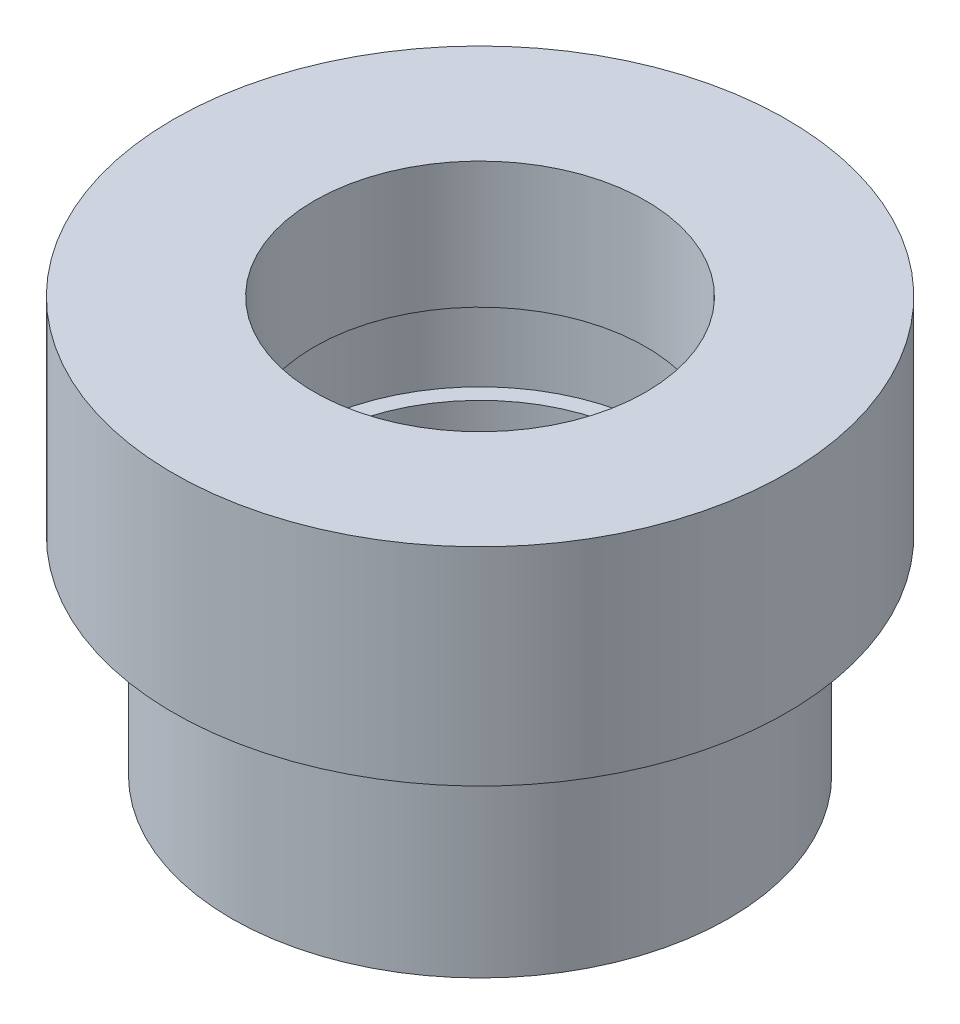
ISO-10303-21;
HEADER;
FILE_DESCRIPTION(('STEP AP214'),'2;1');
FILE_NAME('part.step','',(''),(''),'','','');
FILE_SCHEMA(('AUTOMOTIVE_DESIGN { 1 0 10303 214 1 1 1 1 }'));
ENDSEC;
DATA;
#1=APPLICATION_CONTEXT('core data for automotive mechanical design processes');
#2=APPLICATION_PROTOCOL_DEFINITION('international standard','automotive_design',2000,#1);
#3=PRODUCT_CONTEXT('',#1,'mechanical');
#4=PRODUCT('Part','Part','',(#3));
#5=PRODUCT_RELATED_PRODUCT_CATEGORY('part','',(#4));
#6=PRODUCT_DEFINITION_FORMATION('','',#4);
#7=PRODUCT_DEFINITION_CONTEXT('part definition',#1,'design');
#8=PRODUCT_DEFINITION('design','',#6,#7);
#9=PRODUCT_DEFINITION_SHAPE('','',#8);
#10=(LENGTH_UNIT() NAMED_UNIT(*) SI_UNIT(.MILLI.,.METRE.));
#11=(NAMED_UNIT(*) PLANE_ANGLE_UNIT() SI_UNIT($,.RADIAN.));
#12=(NAMED_UNIT(*) SI_UNIT($,.STERADIAN.) SOLID_ANGLE_UNIT());
#13=UNCERTAINTY_MEASURE_WITH_UNIT(LENGTH_MEASURE(1.E-05),#10,'distance_accuracy_value','');
#14=(GEOMETRIC_REPRESENTATION_CONTEXT(3) GLOBAL_UNCERTAINTY_ASSIGNED_CONTEXT((#13)) GLOBAL_UNIT_ASSIGNED_CONTEXT((#10,
#11,#12)) REPRESENTATION_CONTEXT('',''));
#15=CARTESIAN_POINT('',(0.,0.,0.));
#16=DIRECTION('',(0.,0.,1.));
#17=DIRECTION('',(1.,0.,0.));
#18=AXIS2_PLACEMENT_3D('',#15,#16,#17);
#19=CARTESIAN_POINT('',(-67.3174603174604,64.6709397314852,0.));
#20=DIRECTION('',(0.,1.,0.));
#21=DIRECTION('',(-1.,0.,0.));
#22=AXIS2_PLACEMENT_3D('',#19,#20,#21);
#23=PLANE('',#22);
#24=CARTESIAN_POINT('',(-47.3174603174604,64.6709397314852,0.));
#25=DIRECTION('',(0.,1.,0.));
#26=DIRECTION('',(-1.,0.,0.));
#27=AXIS2_PLACEMENT_3D('',#24,#25,#26);
#28=CIRCLE('',#27,37.);
#29=CARTESIAN_POINT('',(-84.3174603174604,64.6709397314852,0.));
#30=VERTEX_POINT('',#29);
#31=EDGE_CURVE('E10',#30,#30,#28,.T.);
#32=ORIENTED_EDGE('',*,*,#31,.T.);
#33=EDGE_LOOP('',(#32));
#34=FACE_BOUND('',#33,.T.);
#35=CARTESIAN_POINT('',(-47.3174603174604,64.6709397314852,0.));
#36=DIRECTION('',(0.,1.,0.));
#37=DIRECTION('',(-1.,0.,0.));
#38=AXIS2_PLACEMENT_3D('',#35,#36,#37);
#39=CIRCLE('',#38,20.);
#40=CARTESIAN_POINT('',(-67.3174603174604,64.6709397314852,0.));
#41=VERTEX_POINT('',#40);
#42=EDGE_CURVE('E80',#41,#41,#39,.T.);
#43=ORIENTED_EDGE('',*,*,#42,.F.);
#44=EDGE_LOOP('',(#43));
#45=FACE_BOUND('',#44,.T.);
#46=ADVANCED_FACE('F37',(#34,#45),#23,.T.);
#47=CARTESIAN_POINT('',(-47.3174603174604,64.6709397314852,0.));
#48=DIRECTION('',(0.,1.,0.));
#49=DIRECTION('',(-1.,0.,0.));
#50=AXIS2_PLACEMENT_3D('',#47,#48,#49);
#51=CYLINDRICAL_SURFACE('',#50,37.);
#52=CARTESIAN_POINT('',(-47.3174603174604,39.6709397314852,0.));
#53=DIRECTION('',(0.,1.,0.));
#54=DIRECTION('',(-1.,0.,0.));
#55=AXIS2_PLACEMENT_3D('',#52,#53,#54);
#56=CIRCLE('',#55,37.);
#57=CARTESIAN_POINT('',(-84.3174603174604,39.6709397314852,0.));
#58=VERTEX_POINT('',#57);
#59=EDGE_CURVE('E44',#58,#58,#56,.T.);
#60=ORIENTED_EDGE('',*,*,#59,.T.);
#61=EDGE_LOOP('',(#60));
#62=FACE_BOUND('',#61,.T.);
#63=ORIENTED_EDGE('',*,*,#31,.F.);
#64=EDGE_LOOP('',(#63));
#65=FACE_BOUND('',#64,.T.);
#66=ADVANCED_FACE('F89',(#62,#65),#51,.T.);
#67=CARTESIAN_POINT('',(-84.3174603174604,39.6709397314852,0.));
#68=DIRECTION('',(0.,-1.,0.));
#69=DIRECTION('',(1.,0.,0.));
#70=AXIS2_PLACEMENT_3D('',#67,#68,#69);
#71=PLANE('',#70);
#72=CARTESIAN_POINT('',(-47.3174603174604,39.6709397314852,0.));
#73=DIRECTION('',(0.,1.,0.));
#74=DIRECTION('',(-1.,0.,0.));
#75=AXIS2_PLACEMENT_3D('',#72,#73,#74);
#76=CIRCLE('',#75,30.);
#77=CARTESIAN_POINT('',(-77.3174603174604,39.6709397314852,0.));
#78=VERTEX_POINT('',#77);
#79=EDGE_CURVE('E49',#78,#78,#76,.T.);
#80=ORIENTED_EDGE('',*,*,#79,.T.);
#81=EDGE_LOOP('',(#80));
#82=FACE_BOUND('',#81,.T.);
#83=ORIENTED_EDGE('',*,*,#59,.F.);
#84=EDGE_LOOP('',(#83));
#85=FACE_BOUND('',#84,.T.);
#86=ADVANCED_FACE('F93',(#82,#85),#71,.T.);
#87=CARTESIAN_POINT('',(-47.3174603174604,64.6709397314852,0.));
#88=DIRECTION('',(0.,1.,0.));
#89=DIRECTION('',(-1.,0.,0.));
#90=AXIS2_PLACEMENT_3D('',#87,#88,#89);
#91=CYLINDRICAL_SURFACE('',#90,30.);
#92=CARTESIAN_POINT('',(-47.3174603174604,14.6709397314852,0.));
#93=DIRECTION('',(0.,1.,0.));
#94=DIRECTION('',(-1.,0.,0.));
#95=AXIS2_PLACEMENT_3D('',#92,#93,#94);
#96=CIRCLE('',#95,30.);
#97=CARTESIAN_POINT('',(-77.3174603174604,14.6709397314852,0.));
#98=VERTEX_POINT('',#97);
#99=EDGE_CURVE('E54',#98,#98,#96,.T.);
#100=ORIENTED_EDGE('',*,*,#99,.T.);
#101=EDGE_LOOP('',(#100));
#102=FACE_BOUND('',#101,.T.);
#103=ORIENTED_EDGE('',*,*,#79,.F.);
#104=EDGE_LOOP('',(#103));
#105=FACE_BOUND('',#104,.T.);
#106=ADVANCED_FACE('F97',(#102,#105),#91,.T.);
#107=CARTESIAN_POINT('',(-77.3174603174604,14.6709397314852,0.));
#108=DIRECTION('',(0.,-1.,0.));
#109=DIRECTION('',(1.,0.,0.));
#110=AXIS2_PLACEMENT_3D('',#107,#108,#109);
#111=PLANE('',#110);
#112=CARTESIAN_POINT('',(-47.3174603174604,14.6709397314852,0.));
#113=DIRECTION('',(0.,1.,0.));
#114=DIRECTION('',(-1.,0.,0.));
#115=AXIS2_PLACEMENT_3D('',#112,#113,#114);
#116=CIRCLE('',#115,20.);
#117=CARTESIAN_POINT('',(-67.3174603174604,14.6709397314852,0.));
#118=VERTEX_POINT('',#117);
#119=EDGE_CURVE('E60',#118,#118,#116,.T.);
#120=ORIENTED_EDGE('',*,*,#119,.T.);
#121=EDGE_LOOP('',(#120));
#122=FACE_BOUND('',#121,.T.);
#123=ORIENTED_EDGE('',*,*,#99,.F.);
#124=EDGE_LOOP('',(#123));
#125=FACE_BOUND('',#124,.T.);
#126=ADVANCED_FACE('F104',(#122,#125),#111,.T.);
#127=CARTESIAN_POINT('',(-47.3174603174604,64.6709397314852,0.));
#128=DIRECTION('',(0.,1.,0.));
#129=DIRECTION('',(-1.,0.,0.));
#130=AXIS2_PLACEMENT_3D('',#127,#128,#129);
#131=CYLINDRICAL_SURFACE('',#130,20.);
#132=CARTESIAN_POINT('',(-47.3174603174604,39.6709397314852,0.));
#133=DIRECTION('',(0.,1.,0.));
#134=DIRECTION('',(-1.,0.,0.));
#135=AXIS2_PLACEMENT_3D('',#132,#133,#134);
#136=CIRCLE('',#135,20.);
#137=CARTESIAN_POINT('',(-67.3174603174604,39.6709397314852,0.));
#138=VERTEX_POINT('',#137);
#139=EDGE_CURVE('E64',#138,#138,#136,.T.);
#140=ORIENTED_EDGE('',*,*,#139,.T.);
#141=EDGE_LOOP('',(#140));
#142=FACE_BOUND('',#141,.T.);
#143=ORIENTED_EDGE('',*,*,#119,.F.);
#144=EDGE_LOOP('',(#143));
#145=FACE_BOUND('',#144,.T.);
#146=ADVANCED_FACE('F108',(#142,#145),#131,.F.);
#147=CARTESIAN_POINT('',(-67.3174603174604,39.6709397314852,0.));
#148=DIRECTION('',(0.,1.,0.));
#149=DIRECTION('',(-1.,0.,0.));
#150=AXIS2_PLACEMENT_3D('',#147,#148,#149);
#151=PLANE('',#150);
#152=CARTESIAN_POINT('',(-47.3174603174604,39.6709397314852,0.));
#153=DIRECTION('',(0.,1.,0.));
#154=DIRECTION('',(-1.,0.,0.));
#155=AXIS2_PLACEMENT_3D('',#152,#153,#154);
#156=CIRCLE('',#155,22.);
#157=CARTESIAN_POINT('',(-69.3174603174604,39.6709397314852,0.));
#158=VERTEX_POINT('',#157);
#159=EDGE_CURVE('E68',#158,#158,#156,.T.);
#160=ORIENTED_EDGE('',*,*,#159,.T.);
#161=EDGE_LOOP('',(#160));
#162=FACE_BOUND('',#161,.T.);
#163=ORIENTED_EDGE('',*,*,#139,.F.);
#164=EDGE_LOOP('',(#163));
#165=FACE_BOUND('',#164,.T.);
#166=ADVANCED_FACE('F112',(#162,#165),#151,.T.);
#167=CARTESIAN_POINT('',(-47.3174603174604,64.6709397314852,0.));
#168=DIRECTION('',(0.,1.,0.));
#169=DIRECTION('',(-1.,0.,0.));
#170=AXIS2_PLACEMENT_3D('',#167,#168,#169);
#171=CYLINDRICAL_SURFACE('',#170,22.);
#172=CARTESIAN_POINT('',(-47.3174603174604,49.4047619047619,0.));
#173=DIRECTION('',(0.,1.,0.));
#174=DIRECTION('',(-1.,0.,0.));
#175=AXIS2_PLACEMENT_3D('',#172,#173,#174);
#176=CIRCLE('',#175,22.);
#177=CARTESIAN_POINT('',(-69.3174603174604,49.4047619047619,0.));
#178=VERTEX_POINT('',#177);
#179=EDGE_CURVE('E72',#178,#178,#176,.T.);
#180=ORIENTED_EDGE('',*,*,#179,.T.);
#181=EDGE_LOOP('',(#180));
#182=FACE_BOUND('',#181,.T.);
#183=ORIENTED_EDGE('',*,*,#159,.F.);
#184=EDGE_LOOP('',(#183));
#185=FACE_BOUND('',#184,.T.);
#186=ADVANCED_FACE('F116',(#182,#185),#171,.F.);
#187=CARTESIAN_POINT('',(-69.3174603174604,49.4047619047619,0.));
#188=DIRECTION('',(0.,-1.,0.));
#189=DIRECTION('',(1.,0.,0.));
#190=AXIS2_PLACEMENT_3D('',#187,#188,#189);
#191=PLANE('',#190);
#192=CARTESIAN_POINT('',(-47.3174603174604,49.4047619047619,0.));
#193=DIRECTION('',(0.,1.,0.));
#194=DIRECTION('',(-1.,0.,0.));
#195=AXIS2_PLACEMENT_3D('',#192,#193,#194);
#196=CIRCLE('',#195,20.);
#197=CARTESIAN_POINT('',(-67.3174603174604,49.4047619047619,0.));
#198=VERTEX_POINT('',#197);
#199=EDGE_CURVE('E76',#198,#198,#196,.T.);
#200=ORIENTED_EDGE('',*,*,#199,.T.);
#201=EDGE_LOOP('',(#200));
#202=FACE_BOUND('',#201,.T.);
#203=ORIENTED_EDGE('',*,*,#179,.F.);
#204=EDGE_LOOP('',(#203));
#205=FACE_BOUND('',#204,.T.);
#206=ADVANCED_FACE('F120',(#202,#205),#191,.T.);
#207=CARTESIAN_POINT('',(-47.3174603174604,64.6709397314852,0.));
#208=DIRECTION('',(0.,1.,0.));
#209=DIRECTION('',(-1.,0.,0.));
#210=AXIS2_PLACEMENT_3D('',#207,#208,#209);
#211=CYLINDRICAL_SURFACE('',#210,20.);
#212=ORIENTED_EDGE('',*,*,#42,.T.);
#213=EDGE_LOOP('',(#212));
#214=FACE_BOUND('',#213,.T.);
#215=ORIENTED_EDGE('',*,*,#199,.F.);
#216=EDGE_LOOP('',(#215));
#217=FACE_BOUND('',#216,.T.);
#218=ADVANCED_FACE('F85',(#214,#217),#211,.F.);
#219=CLOSED_SHELL('',(#46,#66,#86,#106,#126,#146,#166,#186,#206,#218));
#220=MANIFOLD_SOLID_BREP('B2',#219);
#221=ADVANCED_BREP_SHAPE_REPRESENTATION('',(#18,#220),#14);
#222=SHAPE_DEFINITION_REPRESENTATION(#9,#221);
ENDSEC;
END-ISO-10303-21;
